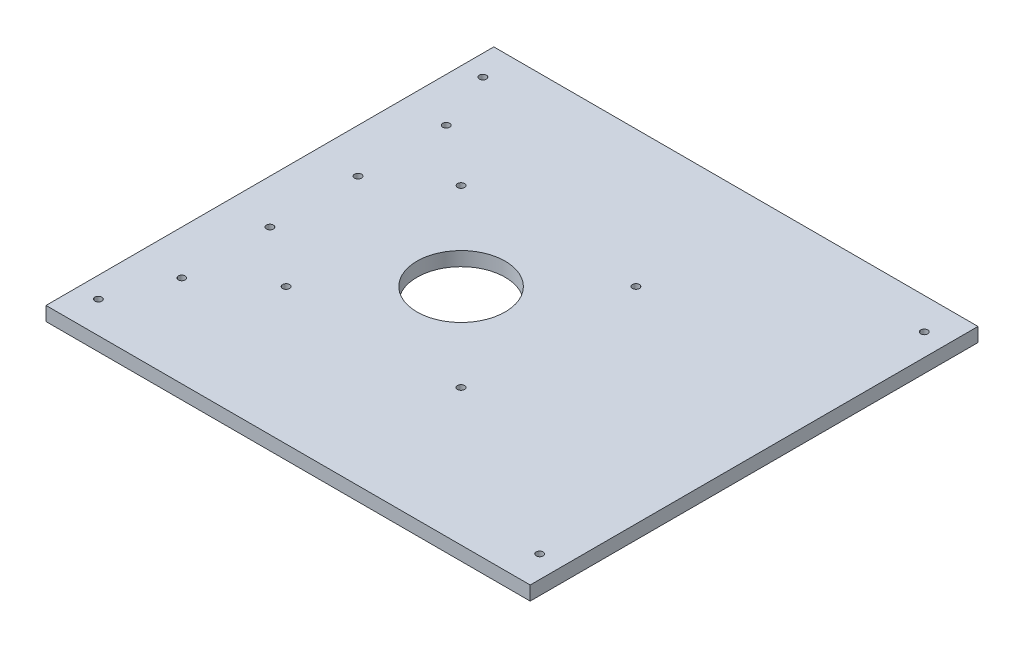
ISO-10303-21;
HEADER;
FILE_DESCRIPTION(('STEP AP214'),'2;1');
FILE_NAME('part.step','',(''),(''),'','','');
FILE_SCHEMA(('AUTOMOTIVE_DESIGN { 1 0 10303 214 1 1 1 1 }'));
ENDSEC;
DATA;
#1=APPLICATION_CONTEXT('core data for automotive mechanical design processes');
#2=APPLICATION_PROTOCOL_DEFINITION('international standard','automotive_design',2000,#1);
#3=PRODUCT_CONTEXT('',#1,'mechanical');
#4=PRODUCT('Part','Part','',(#3));
#5=PRODUCT_RELATED_PRODUCT_CATEGORY('part','',(#4));
#6=PRODUCT_DEFINITION_FORMATION('','',#4);
#7=PRODUCT_DEFINITION_CONTEXT('part definition',#1,'design');
#8=PRODUCT_DEFINITION('design','',#6,#7);
#9=PRODUCT_DEFINITION_SHAPE('','',#8);
#10=(LENGTH_UNIT() NAMED_UNIT(*) SI_UNIT(.MILLI.,.METRE.));
#11=(NAMED_UNIT(*) PLANE_ANGLE_UNIT() SI_UNIT($,.RADIAN.));
#12=(NAMED_UNIT(*) SI_UNIT($,.STERADIAN.) SOLID_ANGLE_UNIT());
#13=UNCERTAINTY_MEASURE_WITH_UNIT(LENGTH_MEASURE(1.E-05),#10,'distance_accuracy_value','');
#14=(GEOMETRIC_REPRESENTATION_CONTEXT(3) GLOBAL_UNCERTAINTY_ASSIGNED_CONTEXT((#13)) GLOBAL_UNIT_ASSIGNED_CONTEXT((#10,
#11,#12)) REPRESENTATION_CONTEXT('',''));
#15=CARTESIAN_POINT('',(0.,0.,0.));
#16=DIRECTION('',(0.,0.,1.));
#17=DIRECTION('',(1.,0.,0.));
#18=AXIS2_PLACEMENT_3D('',#15,#16,#17);
#19=CARTESIAN_POINT('',(-81.3659204114527,6.35,-34.7054744344022));
#20=DIRECTION('',(1.,0.,0.));
#21=DIRECTION('',(0.,0.,-1.));
#22=AXIS2_PLACEMENT_3D('',#19,#20,#21);
#23=PLANE('',#22);
#24=DIRECTION('',(0.,0.,1.));
#25=VECTOR('',#24,1.);
#26=CARTESIAN_POINT('',(-81.3659204114527,0.,-34.7054744344022));
#27=LINE('',#26,#25);
#28=CARTESIAN_POINT('',(-81.3659204114527,0.,-34.7054744344022));
#29=VERTEX_POINT('',#28);
#30=CARTESIAN_POINT('',(-81.3659204114527,0.,168.494525565598));
#31=VERTEX_POINT('',#30);
#32=EDGE_CURVE('E96',#29,#31,#27,.T.);
#33=ORIENTED_EDGE('',*,*,#32,.T.);
#34=DIRECTION('',(0.,-1.,0.));
#35=VECTOR('',#34,1.);
#36=CARTESIAN_POINT('',(-81.3659204114527,6.35,168.494525565598));
#37=LINE('',#36,#35);
#38=CARTESIAN_POINT('',(-81.3659204114527,6.35,168.494525565598));
#39=VERTEX_POINT('',#38);
#40=EDGE_CURVE('E11',#39,#31,#37,.T.);
#41=ORIENTED_EDGE('',*,*,#40,.F.);
#42=DIRECTION('',(0.,0.,1.));
#43=VECTOR('',#42,1.);
#44=CARTESIAN_POINT('',(-81.3659204114527,6.35,-34.7054744344022));
#45=LINE('',#44,#43);
#46=CARTESIAN_POINT('',(-81.3659204114527,6.35,-34.7054744344022));
#47=VERTEX_POINT('',#46);
#48=EDGE_CURVE('E84',#47,#39,#45,.T.);
#49=ORIENTED_EDGE('',*,*,#48,.F.);
#50=DIRECTION('',(0.,-1.,0.));
#51=VECTOR('',#50,1.);
#52=CARTESIAN_POINT('',(-81.3659204114527,6.35,-34.7054744344022));
#53=LINE('',#52,#51);
#54=EDGE_CURVE('E92',#47,#29,#53,.T.);
#55=ORIENTED_EDGE('',*,*,#54,.T.);
#56=EDGE_LOOP('',(#33,#41,#49,#55));
#57=FACE_BOUND('',#56,.T.);
#58=ADVANCED_FACE('F33',(#57),#23,.F.);
#59=CARTESIAN_POINT('',(-81.3659204114527,6.35,168.494525565598));
#60=DIRECTION('',(0.,0.,-1.));
#61=DIRECTION('',(-1.,0.,0.));
#62=AXIS2_PLACEMENT_3D('',#59,#60,#61);
#63=PLANE('',#62);
#64=DIRECTION('',(1.,0.,0.));
#65=VECTOR('',#64,1.);
#66=CARTESIAN_POINT('',(-81.3659204114527,0.,168.494525565598));
#67=LINE('',#66,#65);
#68=CARTESIAN_POINT('',(138.344079588547,0.,168.494525565598));
#69=VERTEX_POINT('',#68);
#70=EDGE_CURVE('E88',#31,#69,#67,.T.);
#71=ORIENTED_EDGE('',*,*,#70,.T.);
#72=DIRECTION('',(0.,-1.,0.));
#73=VECTOR('',#72,1.);
#74=CARTESIAN_POINT('',(138.344079588547,6.35,168.494525565598));
#75=LINE('',#74,#73);
#76=CARTESIAN_POINT('',(138.344079588547,6.35,168.494525565598));
#77=VERTEX_POINT('',#76);
#78=EDGE_CURVE('E41',#77,#69,#75,.T.);
#79=ORIENTED_EDGE('',*,*,#78,.F.);
#80=DIRECTION('',(1.,0.,0.));
#81=VECTOR('',#80,1.);
#82=CARTESIAN_POINT('',(-81.3659204114527,6.35,168.494525565598));
#83=LINE('',#82,#81);
#84=EDGE_CURVE('E79',#39,#77,#83,.T.);
#85=ORIENTED_EDGE('',*,*,#84,.F.);
#86=ORIENTED_EDGE('',*,*,#40,.T.);
#87=EDGE_LOOP('',(#71,#79,#85,#86));
#88=FACE_BOUND('',#87,.T.);
#89=ADVANCED_FACE('F87',(#88),#63,.F.);
#90=CARTESIAN_POINT('',(138.344079588547,6.35,-34.7054744344022));
#91=DIRECTION('',(-1.,0.,0.));
#92=DIRECTION('',(0.,0.,1.));
#93=AXIS2_PLACEMENT_3D('',#90,#91,#92);
#94=PLANE('',#93);
#95=DIRECTION('',(0.,0.,-1.));
#96=VECTOR('',#95,1.);
#97=CARTESIAN_POINT('',(138.344079588547,0.,-34.7054744344022));
#98=LINE('',#97,#96);
#99=CARTESIAN_POINT('',(138.344079588547,0.,-34.7054744344022));
#100=VERTEX_POINT('',#99);
#101=EDGE_CURVE('E66',#69,#100,#98,.T.);
#102=ORIENTED_EDGE('',*,*,#101,.T.);
#103=DIRECTION('',(0.,-1.,0.));
#104=VECTOR('',#103,1.);
#105=CARTESIAN_POINT('',(138.344079588547,6.35,-34.7054744344022));
#106=LINE('',#105,#104);
#107=CARTESIAN_POINT('',(138.344079588547,6.35,-34.7054744344022));
#108=VERTEX_POINT('',#107);
#109=EDGE_CURVE('E89',#108,#100,#106,.T.);
#110=ORIENTED_EDGE('',*,*,#109,.F.);
#111=DIRECTION('',(0.,0.,-1.));
#112=VECTOR('',#111,1.);
#113=CARTESIAN_POINT('',(138.344079588547,6.35,-34.7054744344022));
#114=LINE('',#113,#112);
#115=EDGE_CURVE('E82',#77,#108,#114,.T.);
#116=ORIENTED_EDGE('',*,*,#115,.F.);
#117=ORIENTED_EDGE('',*,*,#78,.T.);
#118=EDGE_LOOP('',(#102,#110,#116,#117));
#119=FACE_BOUND('',#118,.T.);
#120=ADVANCED_FACE('F90',(#119),#94,.F.);
#121=CARTESIAN_POINT('',(-81.3659204114527,6.35,-34.7054744344022));
#122=DIRECTION('',(0.,0.,1.));
#123=DIRECTION('',(1.,0.,0.));
#124=AXIS2_PLACEMENT_3D('',#121,#122,#123);
#125=PLANE('',#124);
#126=DIRECTION('',(-1.,0.,0.));
#127=VECTOR('',#126,1.);
#128=CARTESIAN_POINT('',(-81.3659204114527,0.,-34.7054744344022));
#129=LINE('',#128,#127);
#130=EDGE_CURVE('E72',#100,#29,#129,.T.);
#131=ORIENTED_EDGE('',*,*,#130,.T.);
#132=ORIENTED_EDGE('',*,*,#54,.F.);
#133=DIRECTION('',(-1.,0.,0.));
#134=VECTOR('',#133,1.);
#135=CARTESIAN_POINT('',(-81.3659204114527,6.35,-34.7054744344022));
#136=LINE('',#135,#134);
#137=EDGE_CURVE('E49',#108,#47,#136,.T.);
#138=ORIENTED_EDGE('',*,*,#137,.F.);
#139=ORIENTED_EDGE('',*,*,#109,.T.);
#140=EDGE_LOOP('',(#131,#132,#138,#139));
#141=FACE_BOUND('',#140,.T.);
#142=ADVANCED_FACE('F104',(#141),#125,.F.);
#143=CARTESIAN_POINT('',(0.,6.35,0.));
#144=DIRECTION('',(0.,1.,0.));
#145=DIRECTION('',(0.,0.,1.));
#146=AXIS2_PLACEMENT_3D('',#143,#144,#145);
#147=PLANE('',#146);
#148=CARTESIAN_POINT('',(-71.9552204114527,6.35,154.143525565598));
#149=DIRECTION('',(0.,1.,0.));
#150=DIRECTION('',(0.,0.,1.));
#151=AXIS2_PLACEMENT_3D('',#148,#149,#150);
#152=CIRCLE('',#151,1.5875);
#153=CARTESIAN_POINT('',(-71.9552204114527,6.35,155.731025565598));
#154=VERTEX_POINT('',#153);
#155=EDGE_CURVE('E120',#154,#154,#152,.T.);
#156=ORIENTED_EDGE('',*,*,#155,.F.);
#157=EDGE_LOOP('',(#156));
#158=FACE_BOUND('',#157,.T.);
#159=CARTESIAN_POINT('',(45.0368954991943,6.35,106.582025565598));
#160=DIRECTION('',(0.,1.,0.));
#161=DIRECTION('',(0.,0.,1.));
#162=AXIS2_PLACEMENT_3D('',#159,#160,#161);
#163=CIRCLE('',#162,1.5875);
#164=CARTESIAN_POINT('',(45.0368954991943,6.35,108.169525565598));
#165=VERTEX_POINT('',#164);
#166=EDGE_CURVE('E162',#165,#165,#163,.T.);
#167=ORIENTED_EDGE('',*,*,#166,.F.);
#168=EDGE_LOOP('',(#167));
#169=FACE_BOUND('',#168,.T.);
#170=CARTESIAN_POINT('',(5.38114549919432,6.35,66.8945255655978));
#171=DIRECTION('',(0.,1.,0.));
#172=DIRECTION('',(0.,0.,1.));
#173=AXIS2_PLACEMENT_3D('',#170,#171,#172);
#174=CIRCLE('',#173,20.000000005);
#175=CARTESIAN_POINT('',(5.38114549919432,6.35,86.8945255705978));
#176=VERTEX_POINT('',#175);
#177=EDGE_CURVE('E155',#176,#176,#174,.T.);
#178=ORIENTED_EDGE('',*,*,#177,.F.);
#179=EDGE_LOOP('',(#178));
#180=FACE_BOUND('',#179,.T.);
#181=CARTESIAN_POINT('',(45.0368954991943,6.35,27.2070255655978));
#182=DIRECTION('',(0.,1.,0.));
#183=DIRECTION('',(0.,0.,1.));
#184=AXIS2_PLACEMENT_3D('',#181,#182,#183);
#185=CIRCLE('',#184,1.5875);
#186=CARTESIAN_POINT('',(45.0368954991943,6.35,28.7945255655978));
#187=VERTEX_POINT('',#186);
#188=EDGE_CURVE('E156',#187,#187,#185,.T.);
#189=ORIENTED_EDGE('',*,*,#188,.F.);
#190=EDGE_LOOP('',(#189));
#191=FACE_BOUND('',#190,.T.);
#192=CARTESIAN_POINT('',(128.298379588547,6.35,-20.3544744344022));
#193=DIRECTION('',(0.,1.,0.));
#194=DIRECTION('',(0.,0.,1.));
#195=AXIS2_PLACEMENT_3D('',#192,#193,#194);
#196=CIRCLE('',#195,1.58749999999999);
#197=CARTESIAN_POINT('',(128.298379588547,6.35,-18.7669744344022));
#198=VERTEX_POINT('',#197);
#199=EDGE_CURVE('E179',#198,#198,#196,.T.);
#200=ORIENTED_EDGE('',*,*,#199,.F.);
#201=EDGE_LOOP('',(#200));
#202=FACE_BOUND('',#201,.T.);
#203=CARTESIAN_POINT('',(128.298379588547,6.35,154.143525565598));
#204=DIRECTION('',(0.,1.,0.));
#205=DIRECTION('',(0.,0.,1.));
#206=AXIS2_PLACEMENT_3D('',#203,#204,#205);
#207=CIRCLE('',#206,1.58749999999999);
#208=CARTESIAN_POINT('',(128.298379588547,6.35,155.731025565598));
#209=VERTEX_POINT('',#208);
#210=EDGE_CURVE('E173',#209,#209,#207,.T.);
#211=ORIENTED_EDGE('',*,*,#210,.F.);
#212=EDGE_LOOP('',(#211));
#213=FACE_BOUND('',#212,.T.);
#214=CARTESIAN_POINT('',(-61.3659205334527,6.35,126.894525326598));
#215=DIRECTION('',(0.,1.,0.));
#216=DIRECTION('',(0.,0.,1.));
#217=AXIS2_PLACEMENT_3D('',#214,#215,#216);
#218=CIRCLE('',#217,1.5875);
#219=CARTESIAN_POINT('',(-61.3659205334527,6.35,128.482025326598));
#220=VERTEX_POINT('',#219);
#221=EDGE_CURVE('E119',#220,#220,#218,.T.);
#222=ORIENTED_EDGE('',*,*,#221,.F.);
#223=EDGE_LOOP('',(#222));
#224=FACE_BOUND('',#223,.T.);
#225=CARTESIAN_POINT('',(-34.3063545008057,6.35,106.582025565598));
#226=DIRECTION('',(0.,1.,0.));
#227=DIRECTION('',(0.,0.,1.));
#228=AXIS2_PLACEMENT_3D('',#225,#226,#227);
#229=CIRCLE('',#228,1.5875);
#230=CARTESIAN_POINT('',(-34.3063545008057,6.35,108.169525565598));
#231=VERTEX_POINT('',#230);
#232=EDGE_CURVE('E126',#231,#231,#229,.T.);
#233=ORIENTED_EDGE('',*,*,#232,.F.);
#234=EDGE_LOOP('',(#233));
#235=FACE_BOUND('',#234,.T.);
#236=CARTESIAN_POINT('',(-61.3659205334527,6.35,86.8945255705978));
#237=DIRECTION('',(0.,1.,0.));
#238=DIRECTION('',(0.,0.,1.));
#239=AXIS2_PLACEMENT_3D('',#236,#237,#238);
#240=CIRCLE('',#239,1.5875);
#241=CARTESIAN_POINT('',(-61.3659205334527,6.35,88.4820255705978));
#242=VERTEX_POINT('',#241);
#243=EDGE_CURVE('E132',#242,#242,#240,.T.);
#244=ORIENTED_EDGE('',*,*,#243,.F.);
#245=EDGE_LOOP('',(#244));
#246=FACE_BOUND('',#245,.T.);
#247=CARTESIAN_POINT('',(-61.3659205334527,6.35,46.8945255605978));
#248=DIRECTION('',(0.,1.,0.));
#249=DIRECTION('',(0.,0.,1.));
#250=AXIS2_PLACEMENT_3D('',#247,#248,#249);
#251=CIRCLE('',#250,1.5875);
#252=CARTESIAN_POINT('',(-61.3659205334527,6.35,48.4820255605978));
#253=VERTEX_POINT('',#252);
#254=EDGE_CURVE('E138',#253,#253,#251,.T.);
#255=ORIENTED_EDGE('',*,*,#254,.F.);
#256=EDGE_LOOP('',(#255));
#257=FACE_BOUND('',#256,.T.);
#258=CARTESIAN_POINT('',(-34.3063545008057,6.35,27.2070255655978));
#259=DIRECTION('',(0.,1.,0.));
#260=DIRECTION('',(0.,0.,1.));
#261=AXIS2_PLACEMENT_3D('',#258,#259,#260);
#262=CIRCLE('',#261,1.5875);
#263=CARTESIAN_POINT('',(-34.3063545008057,6.35,28.7945255655978));
#264=VERTEX_POINT('',#263);
#265=EDGE_CURVE('E144',#264,#264,#262,.T.);
#266=ORIENTED_EDGE('',*,*,#265,.F.);
#267=EDGE_LOOP('',(#266));
#268=FACE_BOUND('',#267,.T.);
#269=CARTESIAN_POINT('',(-61.3659205334527,6.35,6.89452555059781));
#270=DIRECTION('',(0.,1.,0.));
#271=DIRECTION('',(0.,0.,1.));
#272=AXIS2_PLACEMENT_3D('',#269,#270,#271);
#273=CIRCLE('',#272,1.5875);
#274=CARTESIAN_POINT('',(-61.3659205334527,6.35,8.48202555059781));
#275=VERTEX_POINT('',#274);
#276=EDGE_CURVE('E113',#275,#275,#273,.T.);
#277=ORIENTED_EDGE('',*,*,#276,.F.);
#278=EDGE_LOOP('',(#277));
#279=FACE_BOUND('',#278,.T.);
#280=CARTESIAN_POINT('',(-71.9552204114527,6.35,-20.3544744344022));
#281=DIRECTION('',(0.,1.,0.));
#282=DIRECTION('',(0.,0.,1.));
#283=AXIS2_PLACEMENT_3D('',#280,#281,#282);
#284=CIRCLE('',#283,1.5875);
#285=CARTESIAN_POINT('',(-71.9552204114527,6.35,-18.7669744344022));
#286=VERTEX_POINT('',#285);
#287=EDGE_CURVE('E110',#286,#286,#284,.T.);
#288=ORIENTED_EDGE('',*,*,#287,.F.);
#289=EDGE_LOOP('',(#288));
#290=FACE_BOUND('',#289,.T.);
#291=ORIENTED_EDGE('',*,*,#48,.T.);
#292=ORIENTED_EDGE('',*,*,#84,.T.);
#293=ORIENTED_EDGE('',*,*,#115,.T.);
#294=ORIENTED_EDGE('',*,*,#137,.T.);
#295=EDGE_LOOP('',(#291,#292,#293,#294));
#296=FACE_BOUND('',#295,.T.);
#297=ADVANCED_FACE('F80',(#158,#169,#180,#191,#202,#213,#224,#235,#246,#257,#268,#279,#290,
#296),#147,.T.);
#298=CARTESIAN_POINT('',(0.,0.,0.));
#299=DIRECTION('',(0.,1.,0.));
#300=DIRECTION('',(0.,0.,1.));
#301=AXIS2_PLACEMENT_3D('',#298,#299,#300);
#302=PLANE('',#301);
#303=CARTESIAN_POINT('',(-71.9552204114527,0.,154.143525565598));
#304=DIRECTION('',(0.,1.,0.));
#305=DIRECTION('',(0.,0.,1.));
#306=AXIS2_PLACEMENT_3D('',#303,#304,#305);
#307=CIRCLE('',#306,1.5875);
#308=CARTESIAN_POINT('',(-71.9552204114527,0.,155.731025565598));
#309=VERTEX_POINT('',#308);
#310=EDGE_CURVE('E165',#309,#309,#307,.T.);
#311=ORIENTED_EDGE('',*,*,#310,.T.);
#312=EDGE_LOOP('',(#311));
#313=FACE_BOUND('',#312,.T.);
#314=CARTESIAN_POINT('',(45.0368954991943,0.,106.582025565598));
#315=DIRECTION('',(0.,1.,0.));
#316=DIRECTION('',(0.,0.,1.));
#317=AXIS2_PLACEMENT_3D('',#314,#315,#316);
#318=CIRCLE('',#317,1.5875);
#319=CARTESIAN_POINT('',(45.0368954991943,0.,108.169525565598));
#320=VERTEX_POINT('',#319);
#321=EDGE_CURVE('E159',#320,#320,#318,.T.);
#322=ORIENTED_EDGE('',*,*,#321,.T.);
#323=EDGE_LOOP('',(#322));
#324=FACE_BOUND('',#323,.T.);
#325=CARTESIAN_POINT('',(5.38114549919432,0.,66.8945255655978));
#326=DIRECTION('',(0.,1.,0.));
#327=DIRECTION('',(0.,0.,1.));
#328=AXIS2_PLACEMENT_3D('',#325,#326,#327);
#329=CIRCLE('',#328,20.000000005);
#330=CARTESIAN_POINT('',(5.38114549919432,0.,86.8945255705978));
#331=VERTEX_POINT('',#330);
#332=EDGE_CURVE('E152',#331,#331,#329,.T.);
#333=ORIENTED_EDGE('',*,*,#332,.T.);
#334=EDGE_LOOP('',(#333));
#335=FACE_BOUND('',#334,.T.);
#336=CARTESIAN_POINT('',(45.0368954991943,0.,27.2070255655978));
#337=DIRECTION('',(0.,1.,0.));
#338=DIRECTION('',(0.,0.,1.));
#339=AXIS2_PLACEMENT_3D('',#336,#337,#338);
#340=CIRCLE('',#339,1.5875);
#341=CARTESIAN_POINT('',(45.0368954991943,0.,28.7945255655978));
#342=VERTEX_POINT('',#341);
#343=EDGE_CURVE('E182',#342,#342,#340,.T.);
#344=ORIENTED_EDGE('',*,*,#343,.T.);
#345=EDGE_LOOP('',(#344));
#346=FACE_BOUND('',#345,.T.);
#347=CARTESIAN_POINT('',(128.298379588547,0.,-20.3544744344022));
#348=DIRECTION('',(0.,1.,0.));
#349=DIRECTION('',(0.,0.,1.));
#350=AXIS2_PLACEMENT_3D('',#347,#348,#349);
#351=CIRCLE('',#350,1.58749999999999);
#352=CARTESIAN_POINT('',(128.298379588547,0.,-18.7669744344022));
#353=VERTEX_POINT('',#352);
#354=EDGE_CURVE('E176',#353,#353,#351,.T.);
#355=ORIENTED_EDGE('',*,*,#354,.T.);
#356=EDGE_LOOP('',(#355));
#357=FACE_BOUND('',#356,.T.);
#358=CARTESIAN_POINT('',(128.298379588547,0.,154.143525565598));
#359=DIRECTION('',(0.,1.,0.));
#360=DIRECTION('',(0.,0.,1.));
#361=AXIS2_PLACEMENT_3D('',#358,#359,#360);
#362=CIRCLE('',#361,1.58749999999999);
#363=CARTESIAN_POINT('',(128.298379588547,0.,155.731025565598));
#364=VERTEX_POINT('',#363);
#365=EDGE_CURVE('E170',#364,#364,#362,.T.);
#366=ORIENTED_EDGE('',*,*,#365,.T.);
#367=EDGE_LOOP('',(#366));
#368=FACE_BOUND('',#367,.T.);
#369=CARTESIAN_POINT('',(-61.3659205334527,0.,126.894525326598));
#370=DIRECTION('',(0.,1.,0.));
#371=DIRECTION('',(0.,0.,1.));
#372=AXIS2_PLACEMENT_3D('',#369,#370,#371);
#373=CIRCLE('',#372,1.5875);
#374=CARTESIAN_POINT('',(-61.3659205334527,0.,128.482025326598));
#375=VERTEX_POINT('',#374);
#376=EDGE_CURVE('E116',#375,#375,#373,.T.);
#377=ORIENTED_EDGE('',*,*,#376,.T.);
#378=EDGE_LOOP('',(#377));
#379=FACE_BOUND('',#378,.T.);
#380=CARTESIAN_POINT('',(-34.3063545008057,0.,106.582025565598));
#381=DIRECTION('',(0.,1.,0.));
#382=DIRECTION('',(0.,0.,1.));
#383=AXIS2_PLACEMENT_3D('',#380,#381,#382);
#384=CIRCLE('',#383,1.5875);
#385=CARTESIAN_POINT('',(-34.3063545008057,0.,108.169525565598));
#386=VERTEX_POINT('',#385);
#387=EDGE_CURVE('E123',#386,#386,#384,.T.);
#388=ORIENTED_EDGE('',*,*,#387,.T.);
#389=EDGE_LOOP('',(#388));
#390=FACE_BOUND('',#389,.T.);
#391=CARTESIAN_POINT('',(-61.3659205334527,0.,86.8945255705978));
#392=DIRECTION('',(0.,1.,0.));
#393=DIRECTION('',(0.,0.,1.));
#394=AXIS2_PLACEMENT_3D('',#391,#392,#393);
#395=CIRCLE('',#394,1.5875);
#396=CARTESIAN_POINT('',(-61.3659205334527,0.,88.4820255705978));
#397=VERTEX_POINT('',#396);
#398=EDGE_CURVE('E129',#397,#397,#395,.T.);
#399=ORIENTED_EDGE('',*,*,#398,.T.);
#400=EDGE_LOOP('',(#399));
#401=FACE_BOUND('',#400,.T.);
#402=CARTESIAN_POINT('',(-61.3659205334527,0.,46.8945255605978));
#403=DIRECTION('',(0.,1.,0.));
#404=DIRECTION('',(0.,0.,1.));
#405=AXIS2_PLACEMENT_3D('',#402,#403,#404);
#406=CIRCLE('',#405,1.5875);
#407=CARTESIAN_POINT('',(-61.3659205334527,0.,48.4820255605978));
#408=VERTEX_POINT('',#407);
#409=EDGE_CURVE('E135',#408,#408,#406,.T.);
#410=ORIENTED_EDGE('',*,*,#409,.T.);
#411=EDGE_LOOP('',(#410));
#412=FACE_BOUND('',#411,.T.);
#413=CARTESIAN_POINT('',(-34.3063545008057,0.,27.2070255655978));
#414=DIRECTION('',(0.,1.,0.));
#415=DIRECTION('',(0.,0.,1.));
#416=AXIS2_PLACEMENT_3D('',#413,#414,#415);
#417=CIRCLE('',#416,1.5875);
#418=CARTESIAN_POINT('',(-34.3063545008057,0.,28.7945255655978));
#419=VERTEX_POINT('',#418);
#420=EDGE_CURVE('E141',#419,#419,#417,.T.);
#421=ORIENTED_EDGE('',*,*,#420,.T.);
#422=EDGE_LOOP('',(#421));
#423=FACE_BOUND('',#422,.T.);
#424=CARTESIAN_POINT('',(-61.3659205334527,0.,6.89452555059781));
#425=DIRECTION('',(0.,1.,0.));
#426=DIRECTION('',(0.,0.,1.));
#427=AXIS2_PLACEMENT_3D('',#424,#425,#426);
#428=CIRCLE('',#427,1.5875);
#429=CARTESIAN_POINT('',(-61.3659205334527,0.,8.48202555059781));
#430=VERTEX_POINT('',#429);
#431=EDGE_CURVE('E147',#430,#430,#428,.T.);
#432=ORIENTED_EDGE('',*,*,#431,.T.);
#433=EDGE_LOOP('',(#432));
#434=FACE_BOUND('',#433,.T.);
#435=CARTESIAN_POINT('',(-71.9552204114527,0.,-20.3544744344022));
#436=DIRECTION('',(0.,1.,0.));
#437=DIRECTION('',(0.,0.,1.));
#438=AXIS2_PLACEMENT_3D('',#435,#436,#437);
#439=CIRCLE('',#438,1.5875);
#440=CARTESIAN_POINT('',(-71.9552204114527,0.,-18.7669744344022));
#441=VERTEX_POINT('',#440);
#442=EDGE_CURVE('E99',#441,#441,#439,.T.);
#443=ORIENTED_EDGE('',*,*,#442,.T.);
#444=EDGE_LOOP('',(#443));
#445=FACE_BOUND('',#444,.T.);
#446=ORIENTED_EDGE('',*,*,#32,.F.);
#447=ORIENTED_EDGE('',*,*,#130,.F.);
#448=ORIENTED_EDGE('',*,*,#101,.F.);
#449=ORIENTED_EDGE('',*,*,#70,.F.);
#450=EDGE_LOOP('',(#446,#447,#448,#449));
#451=FACE_BOUND('',#450,.T.);
#452=ADVANCED_FACE('F107',(#313,#324,#335,#346,#357,#368,#379,#390,#401,#412,#423,#434,#445,
#451),#302,.F.);
#453=CARTESIAN_POINT('',(-71.9552204114527,0.,-20.3544744344022));
#454=DIRECTION('',(0.,1.,0.));
#455=DIRECTION('',(0.,0.,1.));
#456=AXIS2_PLACEMENT_3D('',#453,#454,#455);
#457=CYLINDRICAL_SURFACE('',#456,1.5875);
#458=ORIENTED_EDGE('',*,*,#442,.F.);
#459=EDGE_LOOP('',(#458));
#460=FACE_BOUND('',#459,.T.);
#461=ORIENTED_EDGE('',*,*,#287,.T.);
#462=EDGE_LOOP('',(#461));
#463=FACE_BOUND('',#462,.T.);
#464=ADVANCED_FACE('F212',(#460,#463),#457,.F.);
#465=CARTESIAN_POINT('',(-61.3659205334527,0.,6.89452555059781));
#466=DIRECTION('',(0.,1.,0.));
#467=DIRECTION('',(0.,0.,1.));
#468=AXIS2_PLACEMENT_3D('',#465,#466,#467);
#469=CYLINDRICAL_SURFACE('',#468,1.5875);
#470=ORIENTED_EDGE('',*,*,#431,.F.);
#471=EDGE_LOOP('',(#470));
#472=FACE_BOUND('',#471,.T.);
#473=ORIENTED_EDGE('',*,*,#276,.T.);
#474=EDGE_LOOP('',(#473));
#475=FACE_BOUND('',#474,.T.);
#476=ADVANCED_FACE('F214',(#472,#475),#469,.F.);
#477=CARTESIAN_POINT('',(-34.3063545008057,0.,27.2070255655978));
#478=DIRECTION('',(0.,1.,0.));
#479=DIRECTION('',(0.,0.,1.));
#480=AXIS2_PLACEMENT_3D('',#477,#478,#479);
#481=CYLINDRICAL_SURFACE('',#480,1.5875);
#482=ORIENTED_EDGE('',*,*,#420,.F.);
#483=EDGE_LOOP('',(#482));
#484=FACE_BOUND('',#483,.T.);
#485=ORIENTED_EDGE('',*,*,#265,.T.);
#486=EDGE_LOOP('',(#485));
#487=FACE_BOUND('',#486,.T.);
#488=ADVANCED_FACE('F221',(#484,#487),#481,.F.);
#489=CARTESIAN_POINT('',(-61.3659205334527,0.,46.8945255605978));
#490=DIRECTION('',(0.,1.,0.));
#491=DIRECTION('',(0.,0.,1.));
#492=AXIS2_PLACEMENT_3D('',#489,#490,#491);
#493=CYLINDRICAL_SURFACE('',#492,1.5875);
#494=ORIENTED_EDGE('',*,*,#409,.F.);
#495=EDGE_LOOP('',(#494));
#496=FACE_BOUND('',#495,.T.);
#497=ORIENTED_EDGE('',*,*,#254,.T.);
#498=EDGE_LOOP('',(#497));
#499=FACE_BOUND('',#498,.T.);
#500=ADVANCED_FACE('F269',(#496,#499),#493,.F.);
#501=CARTESIAN_POINT('',(-61.3659205334527,0.,86.8945255705978));
#502=DIRECTION('',(0.,1.,0.));
#503=DIRECTION('',(0.,0.,1.));
#504=AXIS2_PLACEMENT_3D('',#501,#502,#503);
#505=CYLINDRICAL_SURFACE('',#504,1.5875);
#506=ORIENTED_EDGE('',*,*,#398,.F.);
#507=EDGE_LOOP('',(#506));
#508=FACE_BOUND('',#507,.T.);
#509=ORIENTED_EDGE('',*,*,#243,.T.);
#510=EDGE_LOOP('',(#509));
#511=FACE_BOUND('',#510,.T.);
#512=ADVANCED_FACE('F279',(#508,#511),#505,.F.);
#513=CARTESIAN_POINT('',(-34.3063545008057,0.,106.582025565598));
#514=DIRECTION('',(0.,1.,0.));
#515=DIRECTION('',(0.,0.,1.));
#516=AXIS2_PLACEMENT_3D('',#513,#514,#515);
#517=CYLINDRICAL_SURFACE('',#516,1.5875);
#518=ORIENTED_EDGE('',*,*,#387,.F.);
#519=EDGE_LOOP('',(#518));
#520=FACE_BOUND('',#519,.T.);
#521=ORIENTED_EDGE('',*,*,#232,.T.);
#522=EDGE_LOOP('',(#521));
#523=FACE_BOUND('',#522,.T.);
#524=ADVANCED_FACE('F289',(#520,#523),#517,.F.);
#525=CARTESIAN_POINT('',(-61.3659205334527,0.,126.894525326598));
#526=DIRECTION('',(0.,1.,0.));
#527=DIRECTION('',(0.,0.,1.));
#528=AXIS2_PLACEMENT_3D('',#525,#526,#527);
#529=CYLINDRICAL_SURFACE('',#528,1.5875);
#530=ORIENTED_EDGE('',*,*,#376,.F.);
#531=EDGE_LOOP('',(#530));
#532=FACE_BOUND('',#531,.T.);
#533=ORIENTED_EDGE('',*,*,#221,.T.);
#534=EDGE_LOOP('',(#533));
#535=FACE_BOUND('',#534,.T.);
#536=ADVANCED_FACE('F299',(#532,#535),#529,.F.);
#537=CARTESIAN_POINT('',(128.298379588547,0.,154.143525565598));
#538=DIRECTION('',(0.,1.,0.));
#539=DIRECTION('',(0.,0.,1.));
#540=AXIS2_PLACEMENT_3D('',#537,#538,#539);
#541=CYLINDRICAL_SURFACE('',#540,1.58749999999999);
#542=ORIENTED_EDGE('',*,*,#365,.F.);
#543=EDGE_LOOP('',(#542));
#544=FACE_BOUND('',#543,.T.);
#545=ORIENTED_EDGE('',*,*,#210,.T.);
#546=EDGE_LOOP('',(#545));
#547=FACE_BOUND('',#546,.T.);
#548=ADVANCED_FACE('F309',(#544,#547),#541,.F.);
#549=CARTESIAN_POINT('',(128.298379588547,0.,-20.3544744344022));
#550=DIRECTION('',(0.,1.,0.));
#551=DIRECTION('',(0.,0.,1.));
#552=AXIS2_PLACEMENT_3D('',#549,#550,#551);
#553=CYLINDRICAL_SURFACE('',#552,1.58749999999999);
#554=ORIENTED_EDGE('',*,*,#354,.F.);
#555=EDGE_LOOP('',(#554));
#556=FACE_BOUND('',#555,.T.);
#557=ORIENTED_EDGE('',*,*,#199,.T.);
#558=EDGE_LOOP('',(#557));
#559=FACE_BOUND('',#558,.T.);
#560=ADVANCED_FACE('F318',(#556,#559),#553,.F.);
#561=CARTESIAN_POINT('',(45.0368954991943,0.,27.2070255655978));
#562=DIRECTION('',(0.,1.,0.));
#563=DIRECTION('',(0.,0.,1.));
#564=AXIS2_PLACEMENT_3D('',#561,#562,#563);
#565=CYLINDRICAL_SURFACE('',#564,1.5875);
#566=ORIENTED_EDGE('',*,*,#343,.F.);
#567=EDGE_LOOP('',(#566));
#568=FACE_BOUND('',#567,.T.);
#569=ORIENTED_EDGE('',*,*,#188,.T.);
#570=EDGE_LOOP('',(#569));
#571=FACE_BOUND('',#570,.T.);
#572=ADVANCED_FACE('F188',(#568,#571),#565,.F.);
#573=CARTESIAN_POINT('',(5.38114549919432,0.,66.8945255655978));
#574=DIRECTION('',(0.,1.,0.));
#575=DIRECTION('',(0.,0.,1.));
#576=AXIS2_PLACEMENT_3D('',#573,#574,#575);
#577=CYLINDRICAL_SURFACE('',#576,20.000000005);
#578=ORIENTED_EDGE('',*,*,#332,.F.);
#579=EDGE_LOOP('',(#578));
#580=FACE_BOUND('',#579,.T.);
#581=ORIENTED_EDGE('',*,*,#177,.T.);
#582=EDGE_LOOP('',(#581));
#583=FACE_BOUND('',#582,.T.);
#584=ADVANCED_FACE('F337',(#580,#583),#577,.F.);
#585=CARTESIAN_POINT('',(45.0368954991943,0.,106.582025565598));
#586=DIRECTION('',(0.,1.,0.));
#587=DIRECTION('',(0.,0.,1.));
#588=AXIS2_PLACEMENT_3D('',#585,#586,#587);
#589=CYLINDRICAL_SURFACE('',#588,1.5875);
#590=ORIENTED_EDGE('',*,*,#321,.F.);
#591=EDGE_LOOP('',(#590));
#592=FACE_BOUND('',#591,.T.);
#593=ORIENTED_EDGE('',*,*,#166,.T.);
#594=EDGE_LOOP('',(#593));
#595=FACE_BOUND('',#594,.T.);
#596=ADVANCED_FACE('F347',(#592,#595),#589,.F.);
#597=CARTESIAN_POINT('',(-71.9552204114527,0.,154.143525565598));
#598=DIRECTION('',(0.,1.,0.));
#599=DIRECTION('',(0.,0.,1.));
#600=AXIS2_PLACEMENT_3D('',#597,#598,#599);
#601=CYLINDRICAL_SURFACE('',#600,1.5875);
#602=ORIENTED_EDGE('',*,*,#310,.F.);
#603=EDGE_LOOP('',(#602));
#604=FACE_BOUND('',#603,.T.);
#605=ORIENTED_EDGE('',*,*,#155,.T.);
#606=EDGE_LOOP('',(#605));
#607=FACE_BOUND('',#606,.T.);
#608=ADVANCED_FACE('F357',(#604,#607),#601,.F.);
#609=CLOSED_SHELL('',(#58,#89,#120,#142,#297,#452,#464,#476,#488,#500,#512,#524,#536,#548,#560,
#572,#584,#596,#608));
#610=MANIFOLD_SOLID_BREP('B2',#609);
#611=ADVANCED_BREP_SHAPE_REPRESENTATION('',(#18,#610),#14);
#612=SHAPE_DEFINITION_REPRESENTATION(#9,#611);
ENDSEC;
END-ISO-10303-21;
